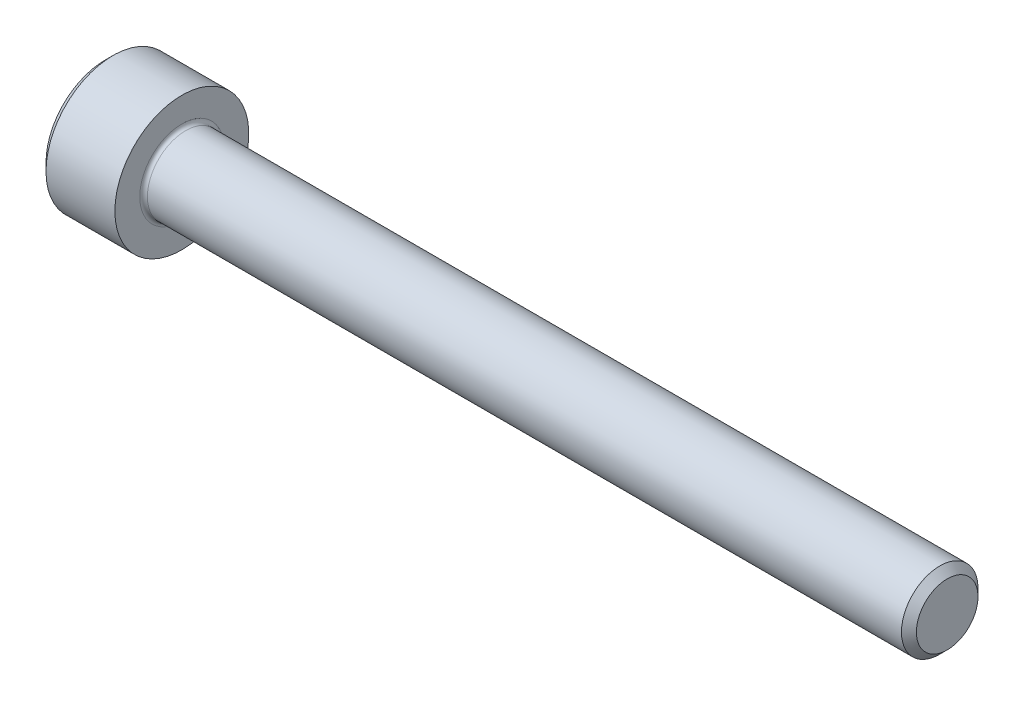
ISO-10303-21;
HEADER;
FILE_DESCRIPTION(('STEP AP214'),'2;1');
FILE_NAME('part.step','',(''),(''),'','','');
FILE_SCHEMA(('AUTOMOTIVE_DESIGN { 1 0 10303 214 1 1 1 1 }'));
ENDSEC;
DATA;
#1=APPLICATION_CONTEXT('core data for automotive mechanical design processes');
#2=APPLICATION_PROTOCOL_DEFINITION('international standard','automotive_design',2000,#1);
#3=PRODUCT_CONTEXT('',#1,'mechanical');
#4=PRODUCT('Part','Part','',(#3));
#5=PRODUCT_RELATED_PRODUCT_CATEGORY('part','',(#4));
#6=PRODUCT_DEFINITION_FORMATION('','',#4);
#7=PRODUCT_DEFINITION_CONTEXT('part definition',#1,'design');
#8=PRODUCT_DEFINITION('design','',#6,#7);
#9=PRODUCT_DEFINITION_SHAPE('','',#8);
#10=(LENGTH_UNIT() NAMED_UNIT(*) SI_UNIT(.MILLI.,.METRE.));
#11=(NAMED_UNIT(*) PLANE_ANGLE_UNIT() SI_UNIT($,.RADIAN.));
#12=(NAMED_UNIT(*) SI_UNIT($,.STERADIAN.) SOLID_ANGLE_UNIT());
#13=UNCERTAINTY_MEASURE_WITH_UNIT(LENGTH_MEASURE(1.E-05),#10,'distance_accuracy_value','');
#14=(GEOMETRIC_REPRESENTATION_CONTEXT(3) GLOBAL_UNCERTAINTY_ASSIGNED_CONTEXT((#13)) GLOBAL_UNIT_ASSIGNED_CONTEXT((#10,
#11,#12)) REPRESENTATION_CONTEXT('',''));
#15=CARTESIAN_POINT('',(0.,0.,0.));
#16=DIRECTION('',(0.,0.,1.));
#17=DIRECTION('',(1.,0.,0.));
#18=AXIS2_PLACEMENT_3D('',#15,#16,#17);
#19=CARTESIAN_POINT('',(0.,0.,0.));
#20=DIRECTION('',(-1.,0.,0.));
#21=DIRECTION('',(0.,0.,1.));
#22=AXIS2_PLACEMENT_3D('',#19,#20,#21);
#23=PLANE('',#22);
#24=DIRECTION('',(0.,-0.499999999999999,0.866025403784439));
#25=VECTOR('',#24,1.);
#26=CARTESIAN_POINT('',(0.,1.77304267668134,0.));
#27=LINE('',#26,#25);
#28=CARTESIAN_POINT('',(0.,1.77304267668134,0.));
#29=VERTEX_POINT('',#28);
#30=CARTESIAN_POINT('',(0.,0.886521338340669,1.5355));
#31=VERTEX_POINT('',#30);
#32=EDGE_CURVE('E395',#29,#31,#27,.T.);
#33=ORIENTED_EDGE('',*,*,#32,.T.);
#34=DIRECTION('',(0.,1.,0.));
#35=VECTOR('',#34,1.);
#36=CARTESIAN_POINT('',(0.,-0.886521338340672,1.5355));
#37=LINE('',#36,#35);
#38=CARTESIAN_POINT('',(0.,-0.886521338340672,1.5355));
#39=VERTEX_POINT('',#38);
#40=EDGE_CURVE('E137',#39,#31,#37,.T.);
#41=ORIENTED_EDGE('',*,*,#40,.F.);
#42=DIRECTION('',(0.,-0.500000000000001,-0.866025403784438));
#43=VECTOR('',#42,1.);
#44=CARTESIAN_POINT('',(0.,-0.886521338340672,1.5355));
#45=LINE('',#44,#43);
#46=CARTESIAN_POINT('',(0.,-1.77304267668134,0.));
#47=VERTEX_POINT('',#46);
#48=EDGE_CURVE('E398',#39,#47,#45,.T.);
#49=ORIENTED_EDGE('',*,*,#48,.T.);
#50=DIRECTION('',(0.,0.499999999999999,-0.866025403784439));
#51=VECTOR('',#50,1.);
#52=CARTESIAN_POINT('',(0.,-1.77304267668134,0.));
#53=LINE('',#52,#51);
#54=CARTESIAN_POINT('',(0.,-0.886521338340676,-1.5355));
#55=VERTEX_POINT('',#54);
#56=EDGE_CURVE('E401',#47,#55,#53,.T.);
#57=ORIENTED_EDGE('',*,*,#56,.T.);
#58=DIRECTION('',(0.,-1.,0.));
#59=VECTOR('',#58,1.);
#60=CARTESIAN_POINT('',(0.,0.886521338340665,-1.5355));
#61=LINE('',#60,#59);
#62=CARTESIAN_POINT('',(0.,0.886521338340665,-1.5355));
#63=VERTEX_POINT('',#62);
#64=EDGE_CURVE('E404',#63,#55,#61,.T.);
#65=ORIENTED_EDGE('',*,*,#64,.F.);
#66=DIRECTION('',(0.,-0.500000000000001,-0.866025403784438));
#67=VECTOR('',#66,1.);
#68=CARTESIAN_POINT('',(0.,1.77304267668134,0.));
#69=LINE('',#68,#67);
#70=EDGE_CURVE('E132',#29,#63,#69,.T.);
#71=ORIENTED_EDGE('',*,*,#70,.F.);
#72=EDGE_LOOP('',(#33,#41,#49,#57,#65,#71));
#73=FACE_BOUND('',#72,.T.);
#74=CARTESIAN_POINT('',(0.,0.,0.));
#75=DIRECTION('',(-1.,0.,0.));
#76=DIRECTION('',(0.,0.,1.));
#77=AXIS2_PLACEMENT_3D('',#74,#75,#76);
#78=CIRCLE('',#77,3.1);
#79=CARTESIAN_POINT('',(0.,0.,3.1));
#80=VERTEX_POINT('',#79);
#81=EDGE_CURVE('E148',#80,#80,#78,.T.);
#82=ORIENTED_EDGE('',*,*,#81,.T.);
#83=EDGE_LOOP('',(#82));
#84=FACE_BOUND('',#83,.T.);
#85=ADVANCED_FACE('F41',(#73,#84),#23,.T.);
#86=CARTESIAN_POINT('',(44.,1.61,0.));
#87=DIRECTION('',(1.,0.,0.));
#88=DIRECTION('',(0.,0.,-1.));
#89=AXIS2_PLACEMENT_3D('',#86,#87,#88);
#90=PLANE('',#89);
#91=CARTESIAN_POINT('',(44.,0.,0.));
#92=DIRECTION('',(-1.,0.,0.));
#93=DIRECTION('',(0.,0.,1.));
#94=AXIS2_PLACEMENT_3D('',#91,#92,#93);
#95=CIRCLE('',#94,1.61);
#96=CARTESIAN_POINT('',(44.,0.,1.61));
#97=VERTEX_POINT('',#96);
#98=EDGE_CURVE('E161',#97,#97,#95,.T.);
#99=ORIENTED_EDGE('',*,*,#98,.F.);
#100=EDGE_LOOP('',(#99));
#101=FACE_BOUND('',#100,.T.);
#102=ADVANCED_FACE('F182',(#101),#90,.T.);
#103=CARTESIAN_POINT('',(44.,0.,0.));
#104=DIRECTION('',(-1.,0.,0.));
#105=DIRECTION('',(0.,0.,1.));
#106=AXIS2_PLACEMENT_3D('',#103,#104,#105);
#107=CONICAL_SURFACE('',#106,1.61,0.785398163397465);
#108=CARTESIAN_POINT('',(43.61,0.,0.));
#109=DIRECTION('',(-1.,0.,0.));
#110=DIRECTION('',(0.,0.,1.));
#111=AXIS2_PLACEMENT_3D('',#108,#109,#110);
#112=CIRCLE('',#111,2.);
#113=CARTESIAN_POINT('',(43.61,0.,2.));
#114=VERTEX_POINT('',#113);
#115=EDGE_CURVE('E158',#114,#114,#112,.T.);
#116=ORIENTED_EDGE('',*,*,#115,.F.);
#117=EDGE_LOOP('',(#116));
#118=FACE_BOUND('',#117,.T.);
#119=ORIENTED_EDGE('',*,*,#98,.T.);
#120=EDGE_LOOP('',(#119));
#121=FACE_BOUND('',#120,.T.);
#122=ADVANCED_FACE('F188',(#118,#121),#107,.T.);
#123=CARTESIAN_POINT('',(-31.75,0.,0.));
#124=DIRECTION('',(-1.,0.,0.));
#125=DIRECTION('',(0.,0.,1.));
#126=AXIS2_PLACEMENT_3D('',#123,#124,#125);
#127=CYLINDRICAL_SURFACE('',#126,2.);
#128=CARTESIAN_POINT('',(4.2,0.,0.));
#129=DIRECTION('',(1.,0.,0.));
#130=DIRECTION('',(0.,0.,-1.));
#131=AXIS2_PLACEMENT_3D('',#128,#129,#130);
#132=CIRCLE('',#131,2.);
#133=CARTESIAN_POINT('',(4.2,0.,-2.));
#134=VERTEX_POINT('',#133);
#135=EDGE_CURVE('E11',#134,#134,#132,.T.);
#136=ORIENTED_EDGE('',*,*,#135,.T.);
#137=EDGE_LOOP('',(#136));
#138=FACE_BOUND('',#137,.T.);
#139=ORIENTED_EDGE('',*,*,#115,.T.);
#140=EDGE_LOOP('',(#139));
#141=FACE_BOUND('',#140,.T.);
#142=ADVANCED_FACE('F199',(#138,#141),#127,.T.);
#143=CARTESIAN_POINT('',(4.,3.5,0.));
#144=DIRECTION('',(1.,0.,0.));
#145=DIRECTION('',(0.,0.,-1.));
#146=AXIS2_PLACEMENT_3D('',#143,#144,#145);
#147=PLANE('',#146);
#148=CARTESIAN_POINT('',(4.,0.,0.));
#149=DIRECTION('',(1.,0.,0.));
#150=DIRECTION('',(0.,0.,-1.));
#151=AXIS2_PLACEMENT_3D('',#148,#149,#150);
#152=CIRCLE('',#151,2.2);
#153=CARTESIAN_POINT('',(4.,0.,-2.2));
#154=VERTEX_POINT('',#153);
#155=EDGE_CURVE('E49',#154,#154,#152,.F.);
#156=ORIENTED_EDGE('',*,*,#155,.T.);
#157=EDGE_LOOP('',(#156));
#158=FACE_BOUND('',#157,.T.);
#159=CARTESIAN_POINT('',(4.,0.,0.));
#160=DIRECTION('',(-1.,0.,0.));
#161=DIRECTION('',(0.,0.,1.));
#162=AXIS2_PLACEMENT_3D('',#159,#160,#161);
#163=CIRCLE('',#162,3.5);
#164=CARTESIAN_POINT('',(4.,0.,3.5));
#165=VERTEX_POINT('',#164);
#166=EDGE_CURVE('E155',#165,#165,#163,.T.);
#167=ORIENTED_EDGE('',*,*,#166,.F.);
#168=EDGE_LOOP('',(#167));
#169=FACE_BOUND('',#168,.T.);
#170=ADVANCED_FACE('F166',(#158,#169),#147,.T.);
#171=CARTESIAN_POINT('',(-31.75,0.,0.));
#172=DIRECTION('',(-1.,0.,0.));
#173=DIRECTION('',(0.,0.,1.));
#174=AXIS2_PLACEMENT_3D('',#171,#172,#173);
#175=CYLINDRICAL_SURFACE('',#174,3.5);
#176=ORIENTED_EDGE('',*,*,#166,.T.);
#177=EDGE_LOOP('',(#176));
#178=FACE_BOUND('',#177,.T.);
#179=CARTESIAN_POINT('',(0.399999999999998,0.,0.));
#180=DIRECTION('',(-1.,0.,0.));
#181=DIRECTION('',(0.,0.,1.));
#182=AXIS2_PLACEMENT_3D('',#179,#180,#181);
#183=CIRCLE('',#182,3.5);
#184=CARTESIAN_POINT('',(0.399999999999998,0.,3.5));
#185=VERTEX_POINT('',#184);
#186=EDGE_CURVE('E152',#185,#185,#183,.T.);
#187=ORIENTED_EDGE('',*,*,#186,.F.);
#188=EDGE_LOOP('',(#187));
#189=FACE_BOUND('',#188,.T.);
#190=ADVANCED_FACE('F177',(#178,#189),#175,.T.);
#191=CARTESIAN_POINT('',(0.,0.,0.));
#192=DIRECTION('',(1.,0.,0.));
#193=DIRECTION('',(0.,0.,-1.));
#194=AXIS2_PLACEMENT_3D('',#191,#192,#193);
#195=CONICAL_SURFACE('',#194,3.1,0.78539816339745);
#196=ORIENTED_EDGE('',*,*,#186,.T.);
#197=EDGE_LOOP('',(#196));
#198=FACE_BOUND('',#197,.T.);
#199=ORIENTED_EDGE('',*,*,#81,.F.);
#200=EDGE_LOOP('',(#199));
#201=FACE_BOUND('',#200,.T.);
#202=ADVANCED_FACE('F170',(#198,#201),#195,.T.);
#203=CARTESIAN_POINT('',(4.2,0.,0.));
#204=DIRECTION('',(1.,0.,0.));
#205=DIRECTION('',(0.,0.,-1.));
#206=AXIS2_PLACEMENT_3D('',#203,#204,#205);
#207=TOROIDAL_SURFACE('',#206,2.2,0.2);
#208=ORIENTED_EDGE('',*,*,#135,.F.);
#209=EDGE_LOOP('',(#208));
#210=FACE_BOUND('',#209,.T.);
#211=ORIENTED_EDGE('',*,*,#155,.F.);
#212=EDGE_LOOP('',(#211));
#213=FACE_BOUND('',#212,.T.);
#214=ADVANCED_FACE('F43',(#210,#213),#207,.F.);
#215=CARTESIAN_POINT('',(2.,1.77304267668134,0.));
#216=DIRECTION('',(0.,-0.866025403784439,-0.499999999999999));
#217=DIRECTION('',(0.,0.499999999999999,-0.866025403784439));
#218=AXIS2_PLACEMENT_3D('',#215,#216,#217);
#219=PLANE('',#218);
#220=ORIENTED_EDGE('',*,*,#32,.F.);
#221=DIRECTION('',(-1.,0.,0.));
#222=VECTOR('',#221,1.);
#223=CARTESIAN_POINT('',(2.,1.77304267668134,0.));
#224=LINE('',#223,#222);
#225=CARTESIAN_POINT('',(2.,1.77304267668134,0.));
#226=VERTEX_POINT('',#225);
#227=EDGE_CURVE('E385',#226,#29,#224,.T.);
#228=ORIENTED_EDGE('',*,*,#227,.F.);
#229=DIRECTION('',(0.,-0.499999999999999,0.866025403784439));
#230=VECTOR('',#229,1.);
#231=CARTESIAN_POINT('',(2.,1.77304267668134,0.));
#232=LINE('',#231,#230);
#233=CARTESIAN_POINT('',(2.,1.329782007511,0.767749999999996));
#234=VERTEX_POINT('',#233);
#235=EDGE_CURVE('E124',#226,#234,#232,.T.);
#236=ORIENTED_EDGE('',*,*,#235,.T.);
#237=CARTESIAN_POINT('',(2.,0.886521338340669,1.5355));
#238=VERTEX_POINT('',#237);
#239=EDGE_CURVE('E115',#234,#238,#232,.T.);
#240=ORIENTED_EDGE('',*,*,#239,.T.);
#241=DIRECTION('',(-1.,0.,0.));
#242=VECTOR('',#241,1.);
#243=CARTESIAN_POINT('',(2.,0.886521338340669,1.5355));
#244=LINE('',#243,#242);
#245=EDGE_CURVE('E129',#238,#31,#244,.T.);
#246=ORIENTED_EDGE('',*,*,#245,.T.);
#247=EDGE_LOOP('',(#220,#228,#236,#240,#246));
#248=FACE_BOUND('',#247,.T.);
#249=ADVANCED_FACE('F128',(#248),#219,.T.);
#250=CARTESIAN_POINT('',(2.,-0.886521338340672,1.5355));
#251=DIRECTION('',(0.,0.,1.));
#252=DIRECTION('',(0.,-1.,0.));
#253=AXIS2_PLACEMENT_3D('',#250,#251,#252);
#254=PLANE('',#253);
#255=ORIENTED_EDGE('',*,*,#40,.T.);
#256=ORIENTED_EDGE('',*,*,#245,.F.);
#257=DIRECTION('',(0.,1.,0.));
#258=VECTOR('',#257,1.);
#259=CARTESIAN_POINT('',(2.,-0.886521338340672,1.5355));
#260=LINE('',#259,#258);
#261=CARTESIAN_POINT('',(2.,0.,1.5355));
#262=VERTEX_POINT('',#261);
#263=EDGE_CURVE('E112',#262,#238,#260,.T.);
#264=ORIENTED_EDGE('',*,*,#263,.F.);
#265=CARTESIAN_POINT('',(2.,-0.886521338340672,1.5355));
#266=VERTEX_POINT('',#265);
#267=EDGE_CURVE('E123',#266,#262,#260,.T.);
#268=ORIENTED_EDGE('',*,*,#267,.F.);
#269=DIRECTION('',(-1.,0.,0.));
#270=VECTOR('',#269,1.);
#271=CARTESIAN_POINT('',(2.,-0.886521338340672,1.5355));
#272=LINE('',#271,#270);
#273=EDGE_CURVE('E139',#266,#39,#272,.T.);
#274=ORIENTED_EDGE('',*,*,#273,.T.);
#275=EDGE_LOOP('',(#255,#256,#264,#268,#274));
#276=FACE_BOUND('',#275,.T.);
#277=ADVANCED_FACE('F134',(#276),#254,.F.);
#278=CARTESIAN_POINT('',(2.,-0.886521338340672,1.5355));
#279=DIRECTION('',(0.,0.866025403784438,-0.500000000000001));
#280=DIRECTION('',(0.,0.500000000000001,0.866025403784438));
#281=AXIS2_PLACEMENT_3D('',#278,#279,#280);
#282=PLANE('',#281);
#283=ORIENTED_EDGE('',*,*,#48,.F.);
#284=ORIENTED_EDGE('',*,*,#273,.F.);
#285=DIRECTION('',(0.,-0.500000000000001,-0.866025403784438));
#286=VECTOR('',#285,1.);
#287=CARTESIAN_POINT('',(2.,-0.886521338340672,1.5355));
#288=LINE('',#287,#286);
#289=CARTESIAN_POINT('',(2.,-1.32978200751101,0.767750000000003));
#290=VERTEX_POINT('',#289);
#291=EDGE_CURVE('E424',#266,#290,#288,.T.);
#292=ORIENTED_EDGE('',*,*,#291,.T.);
#293=CARTESIAN_POINT('',(2.,-1.77304267668134,0.));
#294=VERTEX_POINT('',#293);
#295=EDGE_CURVE('E413',#290,#294,#288,.T.);
#296=ORIENTED_EDGE('',*,*,#295,.T.);
#297=DIRECTION('',(-1.,0.,0.));
#298=VECTOR('',#297,1.);
#299=CARTESIAN_POINT('',(2.,-1.77304267668134,0.));
#300=LINE('',#299,#298);
#301=EDGE_CURVE('E144',#294,#47,#300,.T.);
#302=ORIENTED_EDGE('',*,*,#301,.T.);
#303=EDGE_LOOP('',(#283,#284,#292,#296,#302));
#304=FACE_BOUND('',#303,.T.);
#305=ADVANCED_FACE('F276',(#304),#282,.T.);
#306=CARTESIAN_POINT('',(2.,-1.77304267668134,0.));
#307=DIRECTION('',(0.,0.866025403784439,0.499999999999999));
#308=DIRECTION('',(0.,-0.499999999999999,0.866025403784439));
#309=AXIS2_PLACEMENT_3D('',#306,#307,#308);
#310=PLANE('',#309);
#311=ORIENTED_EDGE('',*,*,#56,.F.);
#312=ORIENTED_EDGE('',*,*,#301,.F.);
#313=DIRECTION('',(0.,0.499999999999999,-0.866025403784439));
#314=VECTOR('',#313,1.);
#315=CARTESIAN_POINT('',(2.,-1.77304267668134,0.));
#316=LINE('',#315,#314);
#317=CARTESIAN_POINT('',(2.,-1.32978200751101,-0.76775));
#318=VERTEX_POINT('',#317);
#319=EDGE_CURVE('E391',#294,#318,#316,.T.);
#320=ORIENTED_EDGE('',*,*,#319,.T.);
#321=CARTESIAN_POINT('',(2.,-0.886521338340676,-1.5355));
#322=VERTEX_POINT('',#321);
#323=EDGE_CURVE('E423',#318,#322,#316,.T.);
#324=ORIENTED_EDGE('',*,*,#323,.T.);
#325=DIRECTION('',(-1.,0.,0.));
#326=VECTOR('',#325,1.);
#327=CARTESIAN_POINT('',(2.,-0.886521338340676,-1.5355));
#328=LINE('',#327,#326);
#329=EDGE_CURVE('E384',#322,#55,#328,.T.);
#330=ORIENTED_EDGE('',*,*,#329,.T.);
#331=EDGE_LOOP('',(#311,#312,#320,#324,#330));
#332=FACE_BOUND('',#331,.T.);
#333=ADVANCED_FACE('F284',(#332),#310,.T.);
#334=CARTESIAN_POINT('',(2.,0.886521338340665,-1.5355));
#335=DIRECTION('',(0.,0.,-1.));
#336=DIRECTION('',(0.,1.,0.));
#337=AXIS2_PLACEMENT_3D('',#334,#335,#336);
#338=PLANE('',#337);
#339=ORIENTED_EDGE('',*,*,#64,.T.);
#340=ORIENTED_EDGE('',*,*,#329,.F.);
#341=DIRECTION('',(0.,-1.,0.));
#342=VECTOR('',#341,1.);
#343=CARTESIAN_POINT('',(2.,0.886521338340665,-1.5355));
#344=LINE('',#343,#342);
#345=CARTESIAN_POINT('',(2.,0.,-1.5355));
#346=VERTEX_POINT('',#345);
#347=EDGE_CURVE('E388',#346,#322,#344,.T.);
#348=ORIENTED_EDGE('',*,*,#347,.F.);
#349=CARTESIAN_POINT('',(2.,0.886521338340665,-1.5355));
#350=VERTEX_POINT('',#349);
#351=EDGE_CURVE('E56',#350,#346,#344,.T.);
#352=ORIENTED_EDGE('',*,*,#351,.F.);
#353=DIRECTION('',(-1.,0.,0.));
#354=VECTOR('',#353,1.);
#355=CARTESIAN_POINT('',(2.,0.886521338340665,-1.5355));
#356=LINE('',#355,#354);
#357=EDGE_CURVE('E381',#350,#63,#356,.T.);
#358=ORIENTED_EDGE('',*,*,#357,.T.);
#359=EDGE_LOOP('',(#339,#340,#348,#352,#358));
#360=FACE_BOUND('',#359,.T.);
#361=ADVANCED_FACE('F293',(#360),#338,.F.);
#362=CARTESIAN_POINT('',(2.,1.77304267668134,0.));
#363=DIRECTION('',(0.,0.866025403784438,-0.500000000000001));
#364=DIRECTION('',(0.,0.500000000000001,0.866025403784438));
#365=AXIS2_PLACEMENT_3D('',#362,#363,#364);
#366=PLANE('',#365);
#367=ORIENTED_EDGE('',*,*,#70,.T.);
#368=ORIENTED_EDGE('',*,*,#357,.F.);
#369=DIRECTION('',(0.,-0.500000000000001,-0.866025403784438));
#370=VECTOR('',#369,1.);
#371=CARTESIAN_POINT('',(2.,1.77304267668134,0.));
#372=LINE('',#371,#370);
#373=CARTESIAN_POINT('',(2.,1.329782007511,-0.76775));
#374=VERTEX_POINT('',#373);
#375=EDGE_CURVE('E371',#374,#350,#372,.T.);
#376=ORIENTED_EDGE('',*,*,#375,.F.);
#377=EDGE_CURVE('E377',#226,#374,#372,.T.);
#378=ORIENTED_EDGE('',*,*,#377,.F.);
#379=ORIENTED_EDGE('',*,*,#227,.T.);
#380=EDGE_LOOP('',(#367,#368,#376,#378,#379));
#381=FACE_BOUND('',#380,.T.);
#382=ADVANCED_FACE('F302',(#381),#366,.F.);
#383=CARTESIAN_POINT('',(2.,2.65956401502201,-1.5355));
#384=DIRECTION('',(1.,0.,0.));
#385=DIRECTION('',(0.,0.,-1.));
#386=AXIS2_PLACEMENT_3D('',#383,#384,#385);
#387=PLANE('',#386);
#388=ORIENTED_EDGE('',*,*,#347,.T.);
#389=ORIENTED_EDGE('',*,*,#323,.F.);
#390=CARTESIAN_POINT('',(2.,0.,0.));
#391=DIRECTION('',(-1.,0.,0.));
#392=DIRECTION('',(0.,0.,1.));
#393=AXIS2_PLACEMENT_3D('',#390,#391,#392);
#394=CIRCLE('',#393,1.5355);
#395=EDGE_CURVE('E419',#346,#318,#394,.T.);
#396=ORIENTED_EDGE('',*,*,#395,.F.);
#397=EDGE_LOOP('',(#388,#389,#396));
#398=FACE_BOUND('',#397,.T.);
#399=ADVANCED_FACE('F311',(#398),#387,.F.);
#400=ORIENTED_EDGE('',*,*,#319,.F.);
#401=ORIENTED_EDGE('',*,*,#295,.F.);
#402=EDGE_CURVE('E142',#318,#290,#394,.T.);
#403=ORIENTED_EDGE('',*,*,#402,.F.);
#404=EDGE_LOOP('',(#400,#401,#403));
#405=FACE_BOUND('',#404,.T.);
#406=ADVANCED_FACE('F320',(#405),#387,.F.);
#407=ORIENTED_EDGE('',*,*,#291,.F.);
#408=ORIENTED_EDGE('',*,*,#267,.T.);
#409=EDGE_CURVE('E138',#290,#262,#394,.T.);
#410=ORIENTED_EDGE('',*,*,#409,.F.);
#411=EDGE_LOOP('',(#407,#408,#410));
#412=FACE_BOUND('',#411,.T.);
#413=ADVANCED_FACE('F329',(#412),#387,.F.);
#414=ORIENTED_EDGE('',*,*,#263,.T.);
#415=ORIENTED_EDGE('',*,*,#239,.F.);
#416=EDGE_CURVE('E118',#262,#234,#394,.T.);
#417=ORIENTED_EDGE('',*,*,#416,.F.);
#418=EDGE_LOOP('',(#414,#415,#417));
#419=FACE_BOUND('',#418,.T.);
#420=ADVANCED_FACE('F114',(#419),#387,.F.);
#421=ORIENTED_EDGE('',*,*,#235,.F.);
#422=ORIENTED_EDGE('',*,*,#377,.T.);
#423=EDGE_CURVE('E149',#234,#374,#394,.T.);
#424=ORIENTED_EDGE('',*,*,#423,.F.);
#425=EDGE_LOOP('',(#421,#422,#424));
#426=FACE_BOUND('',#425,.T.);
#427=ADVANCED_FACE('F344',(#426),#387,.F.);
#428=ORIENTED_EDGE('',*,*,#375,.T.);
#429=ORIENTED_EDGE('',*,*,#351,.T.);
#430=EDGE_CURVE('E374',#374,#346,#394,.T.);
#431=ORIENTED_EDGE('',*,*,#430,.F.);
#432=EDGE_LOOP('',(#428,#429,#431));
#433=FACE_BOUND('',#432,.T.);
#434=ADVANCED_FACE('F259',(#433),#387,.F.);
#435=CARTESIAN_POINT('',(2.,0.,0.));
#436=DIRECTION('',(-1.,0.,0.));
#437=DIRECTION('',(0.,0.,1.));
#438=AXIS2_PLACEMENT_3D('',#435,#436,#437);
#439=CONICAL_SURFACE('',#438,1.5355,1.04719755119659);
#440=CARTESIAN_POINT('',(2.88652133834068,0.,0.));
#441=VERTEX_POINT('',#440);
#442=VERTEX_LOOP('',#441);
#443=FACE_BOUND('',#442,.T.);
#444=ORIENTED_EDGE('',*,*,#416,.T.);
#445=ORIENTED_EDGE('',*,*,#423,.T.);
#446=ORIENTED_EDGE('',*,*,#430,.T.);
#447=ORIENTED_EDGE('',*,*,#395,.T.);
#448=ORIENTED_EDGE('',*,*,#402,.T.);
#449=ORIENTED_EDGE('',*,*,#409,.T.);
#450=EDGE_LOOP('',(#444,#445,#446,#447,#448,#449));
#451=FACE_BOUND('',#450,.T.);
#452=ADVANCED_FACE('F192',(#443,#451),#439,.F.);
#453=CLOSED_SHELL('',(#85,#102,#122,#142,#170,#190,#202,#214,#249,#277,#305,#333,#361,#382,#399,
#406,#413,#420,#427,#434,#452));
#454=MANIFOLD_SOLID_BREP('B2',#453);
#455=ADVANCED_BREP_SHAPE_REPRESENTATION('',(#18,#454),#14);
#456=SHAPE_DEFINITION_REPRESENTATION(#9,#455);
ENDSEC;
END-ISO-10303-21;
